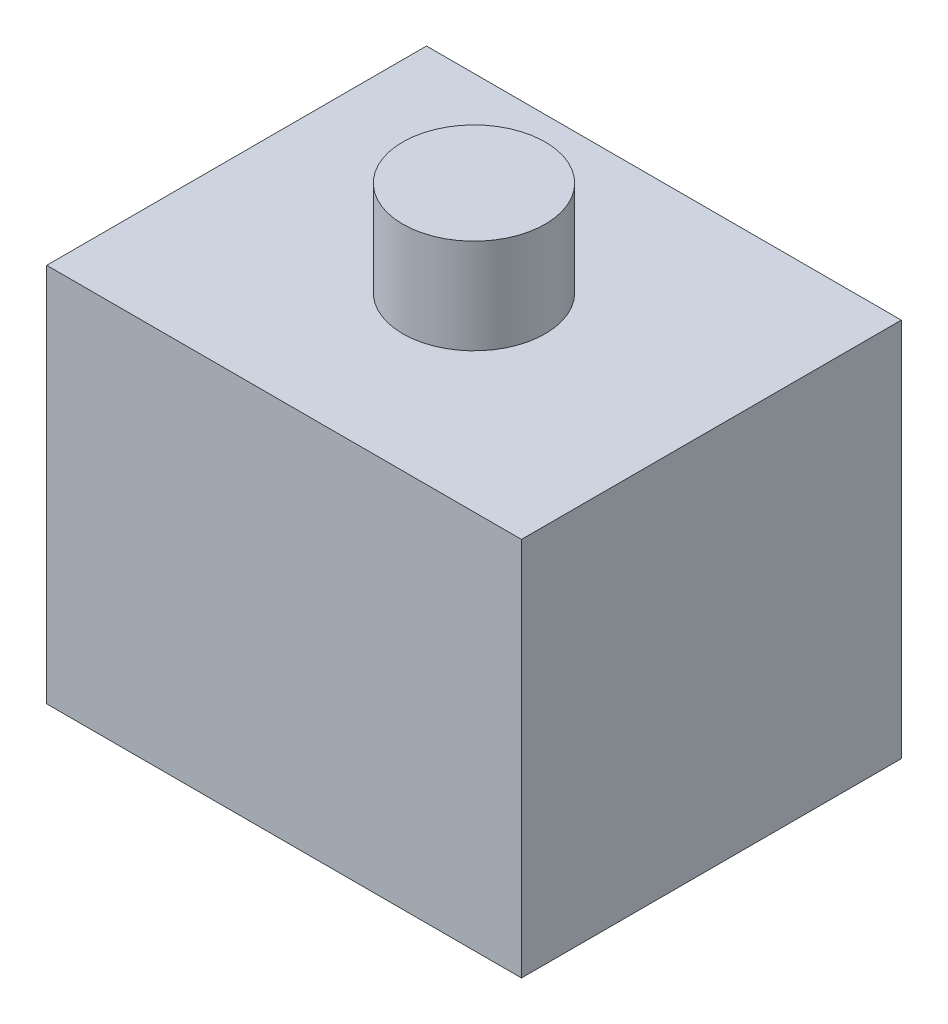
ISO-10303-21;
HEADER;
FILE_DESCRIPTION(('STEP AP214'),'2;1');
FILE_NAME('part.step','',(''),(''),'','','');
FILE_SCHEMA(('AUTOMOTIVE_DESIGN { 1 0 10303 214 1 1 1 1 }'));
ENDSEC;
DATA;
#1=APPLICATION_CONTEXT('core data for automotive mechanical design processes');
#2=APPLICATION_PROTOCOL_DEFINITION('international standard','automotive_design',2000,#1);
#3=PRODUCT_CONTEXT('',#1,'mechanical');
#4=PRODUCT('Part','Part','',(#3));
#5=PRODUCT_RELATED_PRODUCT_CATEGORY('part','',(#4));
#6=PRODUCT_DEFINITION_FORMATION('','',#4);
#7=PRODUCT_DEFINITION_CONTEXT('part definition',#1,'design');
#8=PRODUCT_DEFINITION('design','',#6,#7);
#9=PRODUCT_DEFINITION_SHAPE('','',#8);
#10=(LENGTH_UNIT() NAMED_UNIT(*) SI_UNIT(.MILLI.,.METRE.));
#11=(NAMED_UNIT(*) PLANE_ANGLE_UNIT() SI_UNIT($,.RADIAN.));
#12=(NAMED_UNIT(*) SI_UNIT($,.STERADIAN.) SOLID_ANGLE_UNIT());
#13=UNCERTAINTY_MEASURE_WITH_UNIT(LENGTH_MEASURE(1.E-05),#10,'distance_accuracy_value','');
#14=(GEOMETRIC_REPRESENTATION_CONTEXT(3) GLOBAL_UNCERTAINTY_ASSIGNED_CONTEXT((#13)) GLOBAL_UNIT_ASSIGNED_CONTEXT((#10,
#11,#12)) REPRESENTATION_CONTEXT('',''));
#15=CARTESIAN_POINT('',(0.,0.,0.));
#16=DIRECTION('',(0.,0.,1.));
#17=DIRECTION('',(1.,0.,0.));
#18=AXIS2_PLACEMENT_3D('',#15,#16,#17);
#19=CARTESIAN_POINT('',(-10.,8.,-8.));
#20=DIRECTION('',(1.,0.,0.));
#21=DIRECTION('',(0.,0.,-1.));
#22=AXIS2_PLACEMENT_3D('',#19,#20,#21);
#23=PLANE('',#22);
#24=DIRECTION('',(0.,0.,1.));
#25=VECTOR('',#24,1.);
#26=CARTESIAN_POINT('',(-10.,-8.,-8.));
#27=LINE('',#26,#25);
#28=CARTESIAN_POINT('',(-10.,-8.,-8.));
#29=VERTEX_POINT('',#28);
#30=CARTESIAN_POINT('',(-10.,-8.,8.));
#31=VERTEX_POINT('',#30);
#32=EDGE_CURVE('E105',#29,#31,#27,.T.);
#33=ORIENTED_EDGE('',*,*,#32,.T.);
#34=DIRECTION('',(0.,-1.,0.));
#35=VECTOR('',#34,1.);
#36=CARTESIAN_POINT('',(-10.,8.,8.));
#37=LINE('',#36,#35);
#38=CARTESIAN_POINT('',(-10.,8.,8.));
#39=VERTEX_POINT('',#38);
#40=EDGE_CURVE('E41',#39,#31,#37,.T.);
#41=ORIENTED_EDGE('',*,*,#40,.F.);
#42=DIRECTION('',(0.,0.,1.));
#43=VECTOR('',#42,1.);
#44=CARTESIAN_POINT('',(-10.,8.,-8.));
#45=LINE('',#44,#43);
#46=CARTESIAN_POINT('',(-10.,8.,-8.));
#47=VERTEX_POINT('',#46);
#48=EDGE_CURVE('E92',#47,#39,#45,.T.);
#49=ORIENTED_EDGE('',*,*,#48,.F.);
#50=DIRECTION('',(0.,-1.,0.));
#51=VECTOR('',#50,1.);
#52=CARTESIAN_POINT('',(-10.,8.,-8.));
#53=LINE('',#52,#51);
#54=EDGE_CURVE('E101',#47,#29,#53,.T.);
#55=ORIENTED_EDGE('',*,*,#54,.T.);
#56=EDGE_LOOP('',(#33,#41,#49,#55));
#57=FACE_BOUND('',#56,.T.);
#58=ADVANCED_FACE('F38',(#57),#23,.F.);
#59=CARTESIAN_POINT('',(-10.,8.,8.));
#60=DIRECTION('',(0.,0.,-1.));
#61=DIRECTION('',(-1.,0.,0.));
#62=AXIS2_PLACEMENT_3D('',#59,#60,#61);
#63=PLANE('',#62);
#64=DIRECTION('',(1.,0.,0.));
#65=VECTOR('',#64,1.);
#66=CARTESIAN_POINT('',(-10.,-8.,8.));
#67=LINE('',#66,#65);
#68=CARTESIAN_POINT('',(10.,-8.,8.));
#69=VERTEX_POINT('',#68);
#70=EDGE_CURVE('E97',#31,#69,#67,.T.);
#71=ORIENTED_EDGE('',*,*,#70,.T.);
#72=DIRECTION('',(0.,-1.,0.));
#73=VECTOR('',#72,1.);
#74=CARTESIAN_POINT('',(10.,8.,8.));
#75=LINE('',#74,#73);
#76=CARTESIAN_POINT('',(10.,8.,8.));
#77=VERTEX_POINT('',#76);
#78=EDGE_CURVE('E95',#77,#69,#75,.T.);
#79=ORIENTED_EDGE('',*,*,#78,.F.);
#80=DIRECTION('',(1.,0.,0.));
#81=VECTOR('',#80,1.);
#82=CARTESIAN_POINT('',(-10.,8.,8.));
#83=LINE('',#82,#81);
#84=EDGE_CURVE('E87',#39,#77,#83,.T.);
#85=ORIENTED_EDGE('',*,*,#84,.F.);
#86=ORIENTED_EDGE('',*,*,#40,.T.);
#87=EDGE_LOOP('',(#71,#79,#85,#86));
#88=FACE_BOUND('',#87,.T.);
#89=ADVANCED_FACE('F96',(#88),#63,.F.);
#90=CARTESIAN_POINT('',(10.,8.,-8.));
#91=DIRECTION('',(-1.,0.,0.));
#92=DIRECTION('',(0.,0.,1.));
#93=AXIS2_PLACEMENT_3D('',#90,#91,#92);
#94=PLANE('',#93);
#95=DIRECTION('',(0.,0.,-1.));
#96=VECTOR('',#95,1.);
#97=CARTESIAN_POINT('',(10.,-8.,-8.));
#98=LINE('',#97,#96);
#99=CARTESIAN_POINT('',(10.,-8.,-8.));
#100=VERTEX_POINT('',#99);
#101=EDGE_CURVE('E73',#69,#100,#98,.T.);
#102=ORIENTED_EDGE('',*,*,#101,.T.);
#103=DIRECTION('',(0.,-1.,0.));
#104=VECTOR('',#103,1.);
#105=CARTESIAN_POINT('',(10.,8.,-8.));
#106=LINE('',#105,#104);
#107=CARTESIAN_POINT('',(10.,8.,-8.));
#108=VERTEX_POINT('',#107);
#109=EDGE_CURVE('E98',#108,#100,#106,.T.);
#110=ORIENTED_EDGE('',*,*,#109,.F.);
#111=DIRECTION('',(0.,0.,-1.));
#112=VECTOR('',#111,1.);
#113=CARTESIAN_POINT('',(10.,8.,-8.));
#114=LINE('',#113,#112);
#115=EDGE_CURVE('E90',#77,#108,#114,.T.);
#116=ORIENTED_EDGE('',*,*,#115,.F.);
#117=ORIENTED_EDGE('',*,*,#78,.T.);
#118=EDGE_LOOP('',(#102,#110,#116,#117));
#119=FACE_BOUND('',#118,.T.);
#120=ADVANCED_FACE('F99',(#119),#94,.F.);
#121=CARTESIAN_POINT('',(-10.,8.,-8.));
#122=DIRECTION('',(0.,0.,1.));
#123=DIRECTION('',(1.,0.,0.));
#124=AXIS2_PLACEMENT_3D('',#121,#122,#123);
#125=PLANE('',#124);
#126=CARTESIAN_POINT('',(0.,0.,-8.));
#127=DIRECTION('',(0.,0.,-1.));
#128=DIRECTION('',(-1.,0.,0.));
#129=AXIS2_PLACEMENT_3D('',#126,#127,#128);
#130=CIRCLE('',#129,6.);
#131=CARTESIAN_POINT('',(-6.,0.,-8.));
#132=VERTEX_POINT('',#131);
#133=EDGE_CURVE('E119',#132,#132,#130,.T.);
#134=ORIENTED_EDGE('',*,*,#133,.F.);
#135=EDGE_LOOP('',(#134));
#136=FACE_BOUND('',#135,.T.);
#137=DIRECTION('',(-1.,0.,0.));
#138=VECTOR('',#137,1.);
#139=CARTESIAN_POINT('',(-10.,-8.,-8.));
#140=LINE('',#139,#138);
#141=EDGE_CURVE('E79',#100,#29,#140,.T.);
#142=ORIENTED_EDGE('',*,*,#141,.T.);
#143=ORIENTED_EDGE('',*,*,#54,.F.);
#144=DIRECTION('',(-1.,0.,0.));
#145=VECTOR('',#144,1.);
#146=CARTESIAN_POINT('',(-10.,8.,-8.));
#147=LINE('',#146,#145);
#148=EDGE_CURVE('E56',#108,#47,#147,.T.);
#149=ORIENTED_EDGE('',*,*,#148,.F.);
#150=ORIENTED_EDGE('',*,*,#109,.T.);
#151=EDGE_LOOP('',(#142,#143,#149,#150));
#152=FACE_BOUND('',#151,.T.);
#153=ADVANCED_FACE('F113',(#136,#152),#125,.F.);
#154=CARTESIAN_POINT('',(0.,8.,0.));
#155=DIRECTION('',(0.,1.,0.));
#156=DIRECTION('',(0.,0.,1.));
#157=AXIS2_PLACEMENT_3D('',#154,#155,#156);
#158=PLANE('',#157);
#159=CARTESIAN_POINT('',(0.,8.,0.));
#160=DIRECTION('',(0.,1.,0.));
#161=DIRECTION('',(0.,0.,1.));
#162=AXIS2_PLACEMENT_3D('',#159,#160,#161);
#163=CIRCLE('',#162,3.);
#164=CARTESIAN_POINT('',(0.,8.,3.));
#165=VERTEX_POINT('',#164);
#166=EDGE_CURVE('E11',#165,#165,#163,.T.);
#167=ORIENTED_EDGE('',*,*,#166,.F.);
#168=EDGE_LOOP('',(#167));
#169=FACE_BOUND('',#168,.T.);
#170=ORIENTED_EDGE('',*,*,#48,.T.);
#171=ORIENTED_EDGE('',*,*,#84,.T.);
#172=ORIENTED_EDGE('',*,*,#115,.T.);
#173=ORIENTED_EDGE('',*,*,#148,.T.);
#174=EDGE_LOOP('',(#170,#171,#172,#173));
#175=FACE_BOUND('',#174,.T.);
#176=ADVANCED_FACE('F88',(#169,#175),#158,.T.);
#177=CARTESIAN_POINT('',(0.,-8.,0.));
#178=DIRECTION('',(0.,1.,0.));
#179=DIRECTION('',(0.,0.,1.));
#180=AXIS2_PLACEMENT_3D('',#177,#178,#179);
#181=PLANE('',#180);
#182=CARTESIAN_POINT('',(0.,-8.,0.));
#183=DIRECTION('',(0.,-1.,0.));
#184=DIRECTION('',(0.,0.,-1.));
#185=AXIS2_PLACEMENT_3D('',#182,#183,#184);
#186=CIRCLE('',#185,4.);
#187=CARTESIAN_POINT('',(0.,-8.,-4.));
#188=VERTEX_POINT('',#187);
#189=EDGE_CURVE('E47',#188,#188,#186,.T.);
#190=ORIENTED_EDGE('',*,*,#189,.F.);
#191=EDGE_LOOP('',(#190));
#192=FACE_BOUND('',#191,.T.);
#193=ORIENTED_EDGE('',*,*,#32,.F.);
#194=ORIENTED_EDGE('',*,*,#141,.F.);
#195=ORIENTED_EDGE('',*,*,#101,.F.);
#196=ORIENTED_EDGE('',*,*,#70,.F.);
#197=EDGE_LOOP('',(#193,#194,#195,#196));
#198=FACE_BOUND('',#197,.T.);
#199=ADVANCED_FACE('F116',(#192,#198),#181,.F.);
#200=CARTESIAN_POINT('',(0.,0.,-10.));
#201=DIRECTION('',(0.,0.,1.));
#202=DIRECTION('',(1.,0.,0.));
#203=AXIS2_PLACEMENT_3D('',#200,#201,#202);
#204=CYLINDRICAL_SURFACE('',#203,6.);
#205=CARTESIAN_POINT('',(0.,0.,-10.));
#206=DIRECTION('',(0.,0.,-1.));
#207=DIRECTION('',(-1.,0.,0.));
#208=AXIS2_PLACEMENT_3D('',#205,#206,#207);
#209=CIRCLE('',#208,6.);
#210=CARTESIAN_POINT('',(-6.,0.,-10.));
#211=VERTEX_POINT('',#210);
#212=EDGE_CURVE('E108',#211,#211,#209,.T.);
#213=ORIENTED_EDGE('',*,*,#212,.F.);
#214=EDGE_LOOP('',(#213));
#215=FACE_BOUND('',#214,.T.);
#216=ORIENTED_EDGE('',*,*,#133,.T.);
#217=EDGE_LOOP('',(#216));
#218=FACE_BOUND('',#217,.T.);
#219=ADVANCED_FACE('F148',(#215,#218),#204,.T.);
#220=CARTESIAN_POINT('',(0.,0.,-10.));
#221=DIRECTION('',(0.,0.,-1.));
#222=DIRECTION('',(-1.,0.,0.));
#223=AXIS2_PLACEMENT_3D('',#220,#221,#222);
#224=PLANE('',#223);
#225=ORIENTED_EDGE('',*,*,#212,.T.);
#226=EDGE_LOOP('',(#225));
#227=FACE_BOUND('',#226,.T.);
#228=ADVANCED_FACE('F178',(#227),#224,.T.);
#229=CARTESIAN_POINT('',(0.,-12.,0.));
#230=DIRECTION('',(0.,1.,0.));
#231=DIRECTION('',(0.,0.,1.));
#232=AXIS2_PLACEMENT_3D('',#229,#230,#231);
#233=CYLINDRICAL_SURFACE('',#232,4.);
#234=CARTESIAN_POINT('',(0.,-12.,0.));
#235=DIRECTION('',(0.,-1.,0.));
#236=DIRECTION('',(0.,0.,-1.));
#237=AXIS2_PLACEMENT_3D('',#234,#235,#236);
#238=CIRCLE('',#237,4.);
#239=CARTESIAN_POINT('',(0.,-12.,-4.));
#240=VERTEX_POINT('',#239);
#241=EDGE_CURVE('E124',#240,#240,#238,.T.);
#242=ORIENTED_EDGE('',*,*,#241,.F.);
#243=EDGE_LOOP('',(#242));
#244=FACE_BOUND('',#243,.T.);
#245=ORIENTED_EDGE('',*,*,#189,.T.);
#246=EDGE_LOOP('',(#245));
#247=FACE_BOUND('',#246,.T.);
#248=ADVANCED_FACE('F188',(#244,#247),#233,.T.);
#249=CARTESIAN_POINT('',(0.,-12.,0.));
#250=DIRECTION('',(0.,-1.,0.));
#251=DIRECTION('',(0.,0.,-1.));
#252=AXIS2_PLACEMENT_3D('',#249,#250,#251);
#253=PLANE('',#252);
#254=ORIENTED_EDGE('',*,*,#241,.T.);
#255=EDGE_LOOP('',(#254));
#256=FACE_BOUND('',#255,.T.);
#257=ADVANCED_FACE('F138',(#256),#253,.T.);
#258=CARTESIAN_POINT('',(0.,12.,0.));
#259=DIRECTION('',(0.,-1.,0.));
#260=DIRECTION('',(0.,0.,-1.));
#261=AXIS2_PLACEMENT_3D('',#258,#259,#260);
#262=CYLINDRICAL_SURFACE('',#261,3.);
#263=CARTESIAN_POINT('',(0.,12.,0.));
#264=DIRECTION('',(0.,1.,0.));
#265=DIRECTION('',(0.,0.,1.));
#266=AXIS2_PLACEMENT_3D('',#263,#264,#265);
#267=CIRCLE('',#266,3.);
#268=CARTESIAN_POINT('',(0.,12.,3.));
#269=VERTEX_POINT('',#268);
#270=EDGE_CURVE('E128',#269,#269,#267,.T.);
#271=ORIENTED_EDGE('',*,*,#270,.F.);
#272=EDGE_LOOP('',(#271));
#273=FACE_BOUND('',#272,.T.);
#274=ORIENTED_EDGE('',*,*,#166,.T.);
#275=EDGE_LOOP('',(#274));
#276=FACE_BOUND('',#275,.T.);
#277=ADVANCED_FACE('F135',(#273,#276),#262,.T.);
#278=CARTESIAN_POINT('',(0.,12.,0.));
#279=DIRECTION('',(0.,1.,0.));
#280=DIRECTION('',(0.,0.,1.));
#281=AXIS2_PLACEMENT_3D('',#278,#279,#280);
#282=PLANE('',#281);
#283=ORIENTED_EDGE('',*,*,#270,.T.);
#284=EDGE_LOOP('',(#283));
#285=FACE_BOUND('',#284,.T.);
#286=ADVANCED_FACE('F133',(#285),#282,.T.);
#287=CLOSED_SHELL('',(#58,#89,#120,#153,#176,#199,#219,#228,#248,#257,#277,#286));
#288=MANIFOLD_SOLID_BREP('B2',#287);
#289=ADVANCED_BREP_SHAPE_REPRESENTATION('',(#18,#288),#14);
#290=SHAPE_DEFINITION_REPRESENTATION(#9,#289);
ENDSEC;
END-ISO-10303-21;
